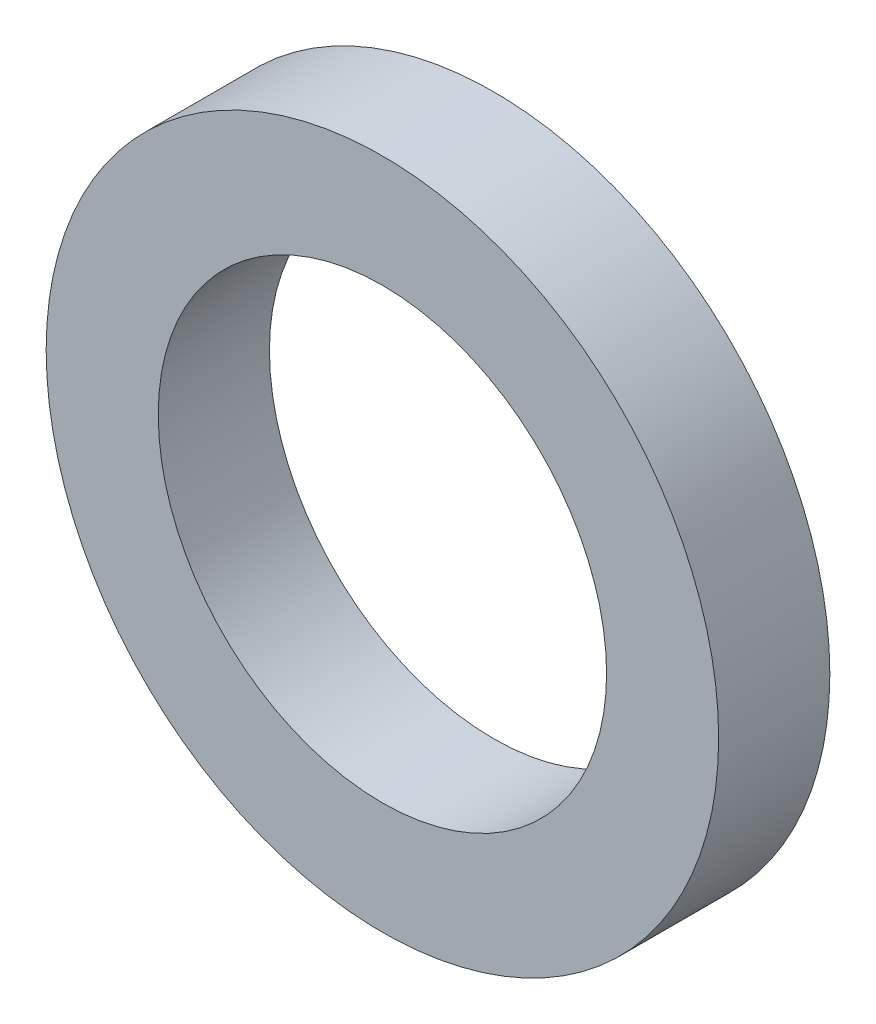
ISO-10303-21;
HEADER;
FILE_DESCRIPTION(('STEP AP214'),'2;1');
FILE_NAME('part.step','',(''),(''),'','','');
FILE_SCHEMA(('AUTOMOTIVE_DESIGN { 1 0 10303 214 1 1 1 1 }'));
ENDSEC;
DATA;
#1=APPLICATION_CONTEXT('core data for automotive mechanical design processes');
#2=APPLICATION_PROTOCOL_DEFINITION('international standard','automotive_design',2000,#1);
#3=PRODUCT_CONTEXT('',#1,'mechanical');
#4=PRODUCT('Part','Part','',(#3));
#5=PRODUCT_RELATED_PRODUCT_CATEGORY('part','',(#4));
#6=PRODUCT_DEFINITION_FORMATION('','',#4);
#7=PRODUCT_DEFINITION_CONTEXT('part definition',#1,'design');
#8=PRODUCT_DEFINITION('design','',#6,#7);
#9=PRODUCT_DEFINITION_SHAPE('','',#8);
#10=(LENGTH_UNIT() NAMED_UNIT(*) SI_UNIT(.MILLI.,.METRE.));
#11=(NAMED_UNIT(*) PLANE_ANGLE_UNIT() SI_UNIT($,.RADIAN.));
#12=(NAMED_UNIT(*) SI_UNIT($,.STERADIAN.) SOLID_ANGLE_UNIT());
#13=UNCERTAINTY_MEASURE_WITH_UNIT(LENGTH_MEASURE(1.E-05),#10,'distance_accuracy_value','');
#14=(GEOMETRIC_REPRESENTATION_CONTEXT(3) GLOBAL_UNCERTAINTY_ASSIGNED_CONTEXT((#13)) GLOBAL_UNIT_ASSIGNED_CONTEXT((#10,
#11,#12)) REPRESENTATION_CONTEXT('',''));
#15=CARTESIAN_POINT('',(0.,0.,0.));
#16=DIRECTION('',(0.,0.,1.));
#17=DIRECTION('',(1.,0.,0.));
#18=AXIS2_PLACEMENT_3D('',#15,#16,#17);
#19=CARTESIAN_POINT('',(0.,0.,0.));
#20=DIRECTION('',(0.,0.,0.999999999999998));
#21=DIRECTION('',(0.999999999999999,0.,0.));
#22=AXIS2_PLACEMENT_3D('',#19,#20,#21);
#23=CYLINDRICAL_SURFACE('',#22,1.5875);
#24=CARTESIAN_POINT('',(0.,0.,0.787399999999994));
#25=DIRECTION('',(0.,0.,0.999999999999998));
#26=DIRECTION('',(0.999999999999999,0.,0.));
#27=AXIS2_PLACEMENT_3D('',#24,#25,#26);
#28=CIRCLE('',#27,1.5875);
#29=CARTESIAN_POINT('',(1.5875,0.,0.787399999999993));
#30=VERTEX_POINT('',#29);
#31=EDGE_CURVE('E12',#30,#30,#28,.T.);
#32=ORIENTED_EDGE('',*,*,#31,.T.);
#33=EDGE_LOOP('',(#32));
#34=FACE_BOUND('',#33,.T.);
#35=CARTESIAN_POINT('',(0.,0.,0.));
#36=DIRECTION('',(0.,0.,0.999999999999998));
#37=DIRECTION('',(0.999999999999999,0.,0.));
#38=AXIS2_PLACEMENT_3D('',#35,#36,#37);
#39=CIRCLE('',#38,1.5875);
#40=CARTESIAN_POINT('',(1.5875,0.,0.));
#41=VERTEX_POINT('',#40);
#42=EDGE_CURVE('E54',#41,#41,#39,.T.);
#43=ORIENTED_EDGE('',*,*,#42,.F.);
#44=EDGE_LOOP('',(#43));
#45=FACE_BOUND('',#44,.T.);
#46=ADVANCED_FACE('F40',(#34,#45),#23,.F.);
#47=CARTESIAN_POINT('',(1.5875,0.,0.787399999999994));
#48=DIRECTION('',(0.,0.,0.999999999999998));
#49=DIRECTION('',(0.999999999999999,0.,0.));
#50=AXIS2_PLACEMENT_3D('',#47,#48,#49);
#51=PLANE('',#50);
#52=CARTESIAN_POINT('',(0.,0.,0.787399999999994));
#53=DIRECTION('',(0.,0.,0.999999999999998));
#54=DIRECTION('',(0.999999999999999,0.,0.));
#55=AXIS2_PLACEMENT_3D('',#52,#53,#54);
#56=CIRCLE('',#55,2.38125);
#57=CARTESIAN_POINT('',(2.38125,0.,0.787399999999993));
#58=VERTEX_POINT('',#57);
#59=EDGE_CURVE('E46',#58,#58,#56,.T.);
#60=ORIENTED_EDGE('',*,*,#59,.T.);
#61=EDGE_LOOP('',(#60));
#62=FACE_BOUND('',#61,.T.);
#63=ORIENTED_EDGE('',*,*,#31,.F.);
#64=EDGE_LOOP('',(#63));
#65=FACE_BOUND('',#64,.T.);
#66=ADVANCED_FACE('F64',(#62,#65),#51,.T.);
#67=CARTESIAN_POINT('',(0.,0.,0.));
#68=DIRECTION('',(0.,0.,0.999999999999998));
#69=DIRECTION('',(0.999999999999999,0.,0.));
#70=AXIS2_PLACEMENT_3D('',#67,#68,#69);
#71=CYLINDRICAL_SURFACE('',#70,2.38125);
#72=CARTESIAN_POINT('',(0.,0.,0.));
#73=DIRECTION('',(0.,0.,0.999999999999998));
#74=DIRECTION('',(0.999999999999999,0.,0.));
#75=AXIS2_PLACEMENT_3D('',#72,#73,#74);
#76=CIRCLE('',#75,2.38125);
#77=CARTESIAN_POINT('',(2.38125,0.,0.));
#78=VERTEX_POINT('',#77);
#79=EDGE_CURVE('E50',#78,#78,#76,.T.);
#80=ORIENTED_EDGE('',*,*,#79,.T.);
#81=EDGE_LOOP('',(#80));
#82=FACE_BOUND('',#81,.T.);
#83=ORIENTED_EDGE('',*,*,#59,.F.);
#84=EDGE_LOOP('',(#83));
#85=FACE_BOUND('',#84,.T.);
#86=ADVANCED_FACE('F68',(#82,#85),#71,.T.);
#87=CARTESIAN_POINT('',(2.38124999999997,0.,0.));
#88=DIRECTION('',(0.,0.,-0.999999999999998));
#89=DIRECTION('',(-0.999999999999999,0.,0.));
#90=AXIS2_PLACEMENT_3D('',#87,#88,#89);
#91=PLANE('',#90);
#92=ORIENTED_EDGE('',*,*,#42,.T.);
#93=EDGE_LOOP('',(#92));
#94=FACE_BOUND('',#93,.T.);
#95=ORIENTED_EDGE('',*,*,#79,.F.);
#96=EDGE_LOOP('',(#95));
#97=FACE_BOUND('',#96,.T.);
#98=ADVANCED_FACE('F60',(#94,#97),#91,.T.);
#99=CLOSED_SHELL('',(#46,#66,#86,#98));
#100=MANIFOLD_SOLID_BREP('B2',#99);
#101=ADVANCED_BREP_SHAPE_REPRESENTATION('',(#18,#100),#14);
#102=SHAPE_DEFINITION_REPRESENTATION(#9,#101);
ENDSEC;
END-ISO-10303-21;
